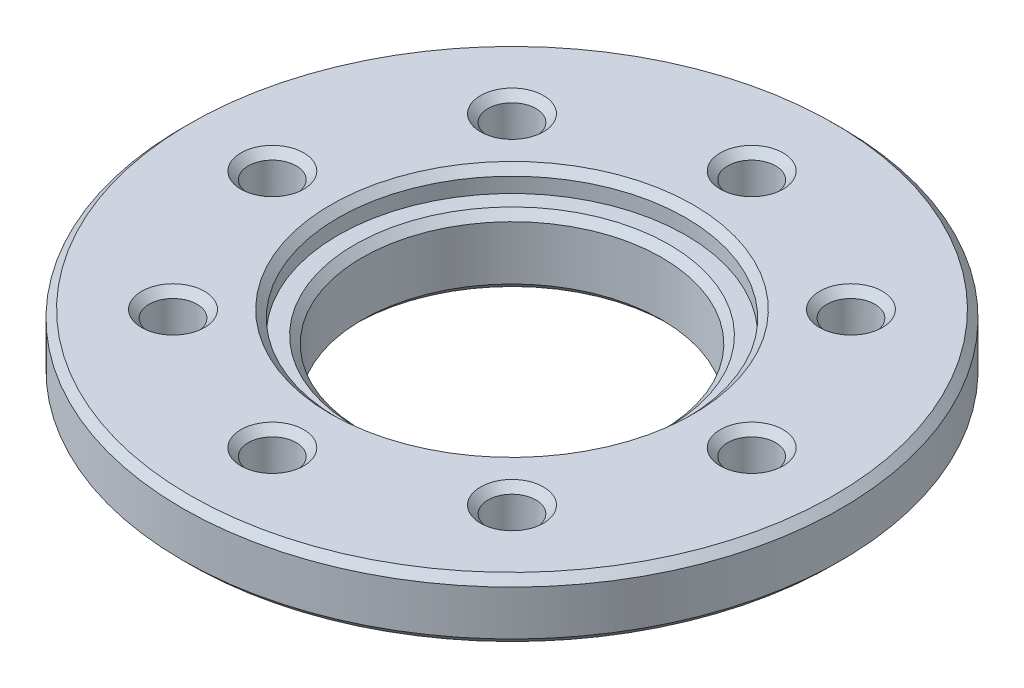
ISO-10303-21;
HEADER;
FILE_DESCRIPTION(('STEP AP214'),'2;1');
FILE_NAME('part.step','',(''),(''),'','','');
FILE_SCHEMA(('AUTOMOTIVE_DESIGN { 1 0 10303 214 1 1 1 1 }'));
ENDSEC;
DATA;
#1=APPLICATION_CONTEXT('core data for automotive mechanical design processes');
#2=APPLICATION_PROTOCOL_DEFINITION('international standard','automotive_design',2000,#1);
#3=PRODUCT_CONTEXT('',#1,'mechanical');
#4=PRODUCT('Part','Part','',(#3));
#5=PRODUCT_RELATED_PRODUCT_CATEGORY('part','',(#4));
#6=PRODUCT_DEFINITION_FORMATION('','',#4);
#7=PRODUCT_DEFINITION_CONTEXT('part definition',#1,'design');
#8=PRODUCT_DEFINITION('design','',#6,#7);
#9=PRODUCT_DEFINITION_SHAPE('','',#8);
#10=(LENGTH_UNIT() NAMED_UNIT(*) SI_UNIT(.MILLI.,.METRE.));
#11=(NAMED_UNIT(*) PLANE_ANGLE_UNIT() SI_UNIT($,.RADIAN.));
#12=(NAMED_UNIT(*) SI_UNIT($,.STERADIAN.) SOLID_ANGLE_UNIT());
#13=UNCERTAINTY_MEASURE_WITH_UNIT(LENGTH_MEASURE(1.E-05),#10,'distance_accuracy_value','');
#14=(GEOMETRIC_REPRESENTATION_CONTEXT(3) GLOBAL_UNCERTAINTY_ASSIGNED_CONTEXT((#13)) GLOBAL_UNIT_ASSIGNED_CONTEXT((#10,
#11,#12)) REPRESENTATION_CONTEXT('',''));
#15=CARTESIAN_POINT('',(0.,0.,0.));
#16=DIRECTION('',(0.,0.,1.));
#17=DIRECTION('',(1.,0.,0.));
#18=AXIS2_PLACEMENT_3D('',#15,#16,#17);
#19=CARTESIAN_POINT('',(0.,0.,0.));
#20=DIRECTION('',(0.,-1.,0.));
#21=DIRECTION('',(0.,0.,-1.));
#22=AXIS2_PLACEMENT_3D('',#19,#20,#21);
#23=CYLINDRICAL_SURFACE('',#22,11.);
#24=CARTESIAN_POINT('',(0.,-1.75000000005246,0.));
#25=DIRECTION('',(0.,-1.,0.));
#26=DIRECTION('',(0.,0.,-1.));
#27=AXIS2_PLACEMENT_3D('',#24,#25,#26);
#28=CIRCLE('',#27,11.);
#29=CARTESIAN_POINT('',(0.,-1.75000000005246,-11.));
#30=VERTEX_POINT('',#29);
#31=EDGE_CURVE('E65',#30,#30,#28,.F.);
#32=ORIENTED_EDGE('',*,*,#31,.T.);
#33=EDGE_LOOP('',(#32));
#34=FACE_BOUND('',#33,.T.);
#35=CARTESIAN_POINT('',(0.,-0.250000000004393,0.));
#36=DIRECTION('',(0.,1.,0.));
#37=DIRECTION('',(0.,0.,1.));
#38=AXIS2_PLACEMENT_3D('',#35,#36,#37);
#39=CIRCLE('',#38,11.);
#40=CARTESIAN_POINT('',(0.,-0.250000000004393,11.));
#41=VERTEX_POINT('',#40);
#42=EDGE_CURVE('E68',#41,#41,#39,.F.);
#43=ORIENTED_EDGE('',*,*,#42,.T.);
#44=EDGE_LOOP('',(#43));
#45=FACE_BOUND('',#44,.T.);
#46=ADVANCED_FACE('F33',(#34,#45),#23,.T.);
#47=CARTESIAN_POINT('',(11.,0.,0.));
#48=DIRECTION('',(0.,1.,0.));
#49=DIRECTION('',(0.,0.,1.));
#50=AXIS2_PLACEMENT_3D('',#47,#48,#49);
#51=PLANE('',#50);
#52=CARTESIAN_POINT('',(8.,0.,0.));
#53=DIRECTION('',(0.,1.,0.));
#54=DIRECTION('',(0.,0.,1.));
#55=AXIS2_PLACEMENT_3D('',#52,#53,#54);
#56=CIRCLE('',#55,1.04999999994757);
#57=CARTESIAN_POINT('',(8.,0.,1.04999999994757));
#58=VERTEX_POINT('',#57);
#59=EDGE_CURVE('E92',#58,#58,#56,.F.);
#60=ORIENTED_EDGE('',*,*,#59,.T.);
#61=EDGE_LOOP('',(#60));
#62=FACE_BOUND('',#61,.T.);
#63=CARTESIAN_POINT('',(-8.,0.,0.));
#64=DIRECTION('',(0.,1.,0.));
#65=DIRECTION('',(0.,0.,1.));
#66=AXIS2_PLACEMENT_3D('',#63,#64,#65);
#67=CIRCLE('',#66,1.04999999994757);
#68=CARTESIAN_POINT('',(-8.,0.,1.04999999994757));
#69=VERTEX_POINT('',#68);
#70=EDGE_CURVE('E95',#69,#69,#67,.F.);
#71=ORIENTED_EDGE('',*,*,#70,.T.);
#72=EDGE_LOOP('',(#71));
#73=FACE_BOUND('',#72,.T.);
#74=CARTESIAN_POINT('',(0.,0.,8.));
#75=DIRECTION('',(0.,1.,0.));
#76=DIRECTION('',(0.,0.,1.));
#77=AXIS2_PLACEMENT_3D('',#74,#75,#76);
#78=CIRCLE('',#77,1.04999999994757);
#79=CARTESIAN_POINT('',(0.,0.,9.04999999994757));
#80=VERTEX_POINT('',#79);
#81=EDGE_CURVE('E98',#80,#80,#78,.F.);
#82=ORIENTED_EDGE('',*,*,#81,.T.);
#83=EDGE_LOOP('',(#82));
#84=FACE_BOUND('',#83,.T.);
#85=CARTESIAN_POINT('',(0.,0.,0.));
#86=DIRECTION('',(0.,1.,0.));
#87=DIRECTION('',(0.,0.,1.));
#88=AXIS2_PLACEMENT_3D('',#85,#86,#87);
#89=CIRCLE('',#88,6.04999999994754);
#90=CARTESIAN_POINT('',(0.,0.,6.04999999994754));
#91=VERTEX_POINT('',#90);
#92=EDGE_CURVE('E101',#91,#91,#89,.F.);
#93=ORIENTED_EDGE('',*,*,#92,.T.);
#94=EDGE_LOOP('',(#93));
#95=FACE_BOUND('',#94,.T.);
#96=CARTESIAN_POINT('',(5.656854249492,0.,5.656854249492));
#97=DIRECTION('',(0.,1.,0.));
#98=DIRECTION('',(0.,0.,1.));
#99=AXIS2_PLACEMENT_3D('',#96,#97,#98);
#100=CIRCLE('',#99,1.04999999994757);
#101=CARTESIAN_POINT('',(5.656854249492,0.,6.70685424943957));
#102=VERTEX_POINT('',#101);
#103=EDGE_CURVE('E104',#102,#102,#100,.F.);
#104=ORIENTED_EDGE('',*,*,#103,.T.);
#105=EDGE_LOOP('',(#104));
#106=FACE_BOUND('',#105,.T.);
#107=CARTESIAN_POINT('',(0.,0.,0.));
#108=DIRECTION('',(0.,1.,0.));
#109=DIRECTION('',(0.,0.,1.));
#110=AXIS2_PLACEMENT_3D('',#107,#108,#109);
#111=CIRCLE('',#110,10.7500000000524);
#112=CARTESIAN_POINT('',(0.,0.,10.7500000000524));
#113=VERTEX_POINT('',#112);
#114=EDGE_CURVE('E107',#113,#113,#111,.T.);
#115=ORIENTED_EDGE('',*,*,#114,.T.);
#116=EDGE_LOOP('',(#115));
#117=FACE_BOUND('',#116,.T.);
#118=CARTESIAN_POINT('',(-5.656854249492,0.,5.656854249492));
#119=DIRECTION('',(0.,1.,0.));
#120=DIRECTION('',(0.,0.,1.));
#121=AXIS2_PLACEMENT_3D('',#118,#119,#120);
#122=CIRCLE('',#121,1.04999999994757);
#123=CARTESIAN_POINT('',(-5.656854249492,0.,6.70685424943957));
#124=VERTEX_POINT('',#123);
#125=EDGE_CURVE('E110',#124,#124,#122,.F.);
#126=ORIENTED_EDGE('',*,*,#125,.T.);
#127=EDGE_LOOP('',(#126));
#128=FACE_BOUND('',#127,.T.);
#129=CARTESIAN_POINT('',(-5.656854249492,0.,-5.656854249492));
#130=DIRECTION('',(0.,1.,0.));
#131=DIRECTION('',(0.,0.,1.));
#132=AXIS2_PLACEMENT_3D('',#129,#130,#131);
#133=CIRCLE('',#132,1.04999999994757);
#134=CARTESIAN_POINT('',(-5.656854249492,0.,-4.60685424954443));
#135=VERTEX_POINT('',#134);
#136=EDGE_CURVE('E113',#135,#135,#133,.F.);
#137=ORIENTED_EDGE('',*,*,#136,.T.);
#138=EDGE_LOOP('',(#137));
#139=FACE_BOUND('',#138,.T.);
#140=CARTESIAN_POINT('',(0.,0.,-8.));
#141=DIRECTION('',(0.,1.,0.));
#142=DIRECTION('',(0.,0.,1.));
#143=AXIS2_PLACEMENT_3D('',#140,#141,#142);
#144=CIRCLE('',#143,1.04999999994757);
#145=CARTESIAN_POINT('',(0.,0.,-6.95000000005243));
#146=VERTEX_POINT('',#145);
#147=EDGE_CURVE('E116',#146,#146,#144,.F.);
#148=ORIENTED_EDGE('',*,*,#147,.T.);
#149=EDGE_LOOP('',(#148));
#150=FACE_BOUND('',#149,.T.);
#151=CARTESIAN_POINT('',(5.656854249492,0.,-5.656854249492));
#152=DIRECTION('',(0.,1.,0.));
#153=DIRECTION('',(0.,0.,1.));
#154=AXIS2_PLACEMENT_3D('',#151,#152,#153);
#155=CIRCLE('',#154,1.04999999994757);
#156=CARTESIAN_POINT('',(5.656854249492,0.,-4.60685424954443));
#157=VERTEX_POINT('',#156);
#158=EDGE_CURVE('E119',#157,#157,#155,.F.);
#159=ORIENTED_EDGE('',*,*,#158,.T.);
#160=EDGE_LOOP('',(#159));
#161=FACE_BOUND('',#160,.T.);
#162=ADVANCED_FACE('F173',(#62,#73,#84,#95,#106,#117,#128,#139,#150,#161),#51,.T.);
#163=CARTESIAN_POINT('',(0.,-2.,0.));
#164=DIRECTION('',(0.,-1.,0.));
#165=DIRECTION('',(0.,0.,-1.));
#166=AXIS2_PLACEMENT_3D('',#163,#164,#165);
#167=PLANE('',#166);
#168=CARTESIAN_POINT('',(0.,-2.,0.));
#169=DIRECTION('',(0.,-1.,0.));
#170=DIRECTION('',(0.,0.,-1.));
#171=AXIS2_PLACEMENT_3D('',#168,#169,#170);
#172=CIRCLE('',#171,10.7499999999956);
#173=CARTESIAN_POINT('',(0.,-2.,-10.7499999999956));
#174=VERTEX_POINT('',#173);
#175=EDGE_CURVE('E71',#174,#174,#172,.T.);
#176=ORIENTED_EDGE('',*,*,#175,.T.);
#177=EDGE_LOOP('',(#176));
#178=FACE_BOUND('',#177,.T.);
#179=CARTESIAN_POINT('',(0.,-2.,-8.));
#180=DIRECTION('',(0.,-1.,0.));
#181=DIRECTION('',(0.,0.,-1.));
#182=AXIS2_PLACEMENT_3D('',#179,#180,#181);
#183=CIRCLE('',#182,0.800000000000014);
#184=CARTESIAN_POINT('',(0.,-2.,-8.80000000000001));
#185=VERTEX_POINT('',#184);
#186=EDGE_CURVE('E126',#185,#185,#183,.T.);
#187=ORIENTED_EDGE('',*,*,#186,.F.);
#188=EDGE_LOOP('',(#187));
#189=FACE_BOUND('',#188,.T.);
#190=CARTESIAN_POINT('',(5.656854249492,-2.,-5.656854249492));
#191=DIRECTION('',(0.,-1.,0.));
#192=DIRECTION('',(0.,0.,-1.));
#193=AXIS2_PLACEMENT_3D('',#190,#191,#192);
#194=CIRCLE('',#193,0.800000000000014);
#195=CARTESIAN_POINT('',(5.656854249492,-2.,-6.45685424949201));
#196=VERTEX_POINT('',#195);
#197=EDGE_CURVE('E129',#196,#196,#194,.T.);
#198=ORIENTED_EDGE('',*,*,#197,.F.);
#199=EDGE_LOOP('',(#198));
#200=FACE_BOUND('',#199,.T.);
#201=CARTESIAN_POINT('',(8.,-2.,0.));
#202=DIRECTION('',(0.,-1.,0.));
#203=DIRECTION('',(0.,0.,-1.));
#204=AXIS2_PLACEMENT_3D('',#201,#202,#203);
#205=CIRCLE('',#204,0.800000000000014);
#206=CARTESIAN_POINT('',(8.,-2.,-0.800000000000014));
#207=VERTEX_POINT('',#206);
#208=EDGE_CURVE('E133',#207,#207,#205,.T.);
#209=ORIENTED_EDGE('',*,*,#208,.F.);
#210=EDGE_LOOP('',(#209));
#211=FACE_BOUND('',#210,.T.);
#212=CARTESIAN_POINT('',(5.656854249492,-2.,5.656854249492));
#213=DIRECTION('',(0.,-1.,0.));
#214=DIRECTION('',(0.,0.,-1.));
#215=AXIS2_PLACEMENT_3D('',#212,#213,#214);
#216=CIRCLE('',#215,0.800000000000014);
#217=CARTESIAN_POINT('',(5.656854249492,-2.,4.85685424949199));
#218=VERTEX_POINT('',#217);
#219=EDGE_CURVE('E148',#218,#218,#216,.T.);
#220=ORIENTED_EDGE('',*,*,#219,.F.);
#221=EDGE_LOOP('',(#220));
#222=FACE_BOUND('',#221,.T.);
#223=CARTESIAN_POINT('',(0.,-2.,8.));
#224=DIRECTION('',(0.,-1.,0.));
#225=DIRECTION('',(0.,0.,-1.));
#226=AXIS2_PLACEMENT_3D('',#223,#224,#225);
#227=CIRCLE('',#226,0.800000000000014);
#228=CARTESIAN_POINT('',(0.,-2.,7.19999999999999));
#229=VERTEX_POINT('',#228);
#230=EDGE_CURVE('E145',#229,#229,#227,.T.);
#231=ORIENTED_EDGE('',*,*,#230,.F.);
#232=EDGE_LOOP('',(#231));
#233=FACE_BOUND('',#232,.T.);
#234=CARTESIAN_POINT('',(-5.656854249492,-2.,5.656854249492));
#235=DIRECTION('',(0.,-1.,0.));
#236=DIRECTION('',(0.,0.,-1.));
#237=AXIS2_PLACEMENT_3D('',#234,#235,#236);
#238=CIRCLE('',#237,0.800000000000014);
#239=CARTESIAN_POINT('',(-5.656854249492,-2.,4.85685424949199));
#240=VERTEX_POINT('',#239);
#241=EDGE_CURVE('E138',#240,#240,#238,.T.);
#242=ORIENTED_EDGE('',*,*,#241,.F.);
#243=EDGE_LOOP('',(#242));
#244=FACE_BOUND('',#243,.T.);
#245=CARTESIAN_POINT('',(-8.,-2.,0.));
#246=DIRECTION('',(0.,-1.,0.));
#247=DIRECTION('',(0.,0.,-1.));
#248=AXIS2_PLACEMENT_3D('',#245,#246,#247);
#249=CIRCLE('',#248,0.800000000000014);
#250=CARTESIAN_POINT('',(-8.,-2.,-0.800000000000014));
#251=VERTEX_POINT('',#250);
#252=EDGE_CURVE('E134',#251,#251,#249,.T.);
#253=ORIENTED_EDGE('',*,*,#252,.F.);
#254=EDGE_LOOP('',(#253));
#255=FACE_BOUND('',#254,.T.);
#256=CARTESIAN_POINT('',(-5.656854249492,-2.,-5.656854249492));
#257=DIRECTION('',(0.,-1.,0.));
#258=DIRECTION('',(0.,0.,-1.));
#259=AXIS2_PLACEMENT_3D('',#256,#257,#258);
#260=CIRCLE('',#259,0.800000000000014);
#261=CARTESIAN_POINT('',(-5.656854249492,-2.,-6.45685424949201));
#262=VERTEX_POINT('',#261);
#263=EDGE_CURVE('E137',#262,#262,#260,.T.);
#264=ORIENTED_EDGE('',*,*,#263,.F.);
#265=EDGE_LOOP('',(#264));
#266=FACE_BOUND('',#265,.T.);
#267=CARTESIAN_POINT('',(0.,-2.,0.));
#268=DIRECTION('',(0.,-1.,0.));
#269=DIRECTION('',(0.,0.,-1.));
#270=AXIS2_PLACEMENT_3D('',#267,#268,#269);
#271=CIRCLE('',#270,6.25);
#272=CARTESIAN_POINT('',(0.,-2.,-6.25));
#273=VERTEX_POINT('',#272);
#274=EDGE_CURVE('E125',#273,#273,#271,.T.);
#275=ORIENTED_EDGE('',*,*,#274,.F.);
#276=EDGE_LOOP('',(#275));
#277=FACE_BOUND('',#276,.T.);
#278=ADVANCED_FACE('F179',(#178,#189,#200,#211,#222,#233,#244,#255,#266,#277),#167,.T.);
#279=CARTESIAN_POINT('',(0.,-3.05,0.));
#280=DIRECTION('',(0.,1.,0.));
#281=DIRECTION('',(0.,0.,1.));
#282=AXIS2_PLACEMENT_3D('',#279,#280,#281);
#283=CYLINDRICAL_SURFACE('',#282,6.25);
#284=CARTESIAN_POINT('',(0.,-2.80000000005244,0.));
#285=DIRECTION('',(0.,-1.,0.));
#286=DIRECTION('',(0.,0.,-1.));
#287=AXIS2_PLACEMENT_3D('',#284,#285,#286);
#288=CIRCLE('',#287,6.25);
#289=CARTESIAN_POINT('',(0.,-2.80000000005244,-6.25));
#290=VERTEX_POINT('',#289);
#291=EDGE_CURVE('E53',#290,#290,#288,.F.);
#292=ORIENTED_EDGE('',*,*,#291,.T.);
#293=EDGE_LOOP('',(#292));
#294=FACE_BOUND('',#293,.T.);
#295=ORIENTED_EDGE('',*,*,#274,.T.);
#296=EDGE_LOOP('',(#295));
#297=FACE_BOUND('',#296,.T.);
#298=ADVANCED_FACE('F277',(#294,#297),#283,.T.);
#299=CARTESIAN_POINT('',(0.,-3.05,0.));
#300=DIRECTION('',(0.,-1.,0.));
#301=DIRECTION('',(0.,0.,-1.));
#302=AXIS2_PLACEMENT_3D('',#299,#300,#301);
#303=PLANE('',#302);
#304=CARTESIAN_POINT('',(0.,-3.05,0.));
#305=DIRECTION('',(0.,-1.,0.));
#306=DIRECTION('',(0.,0.,-1.));
#307=AXIS2_PLACEMENT_3D('',#304,#305,#306);
#308=CIRCLE('',#307,5.25000000000441);
#309=CARTESIAN_POINT('',(0.,-3.05,-5.25000000000441));
#310=VERTEX_POINT('',#309);
#311=EDGE_CURVE('E80',#310,#310,#308,.F.);
#312=ORIENTED_EDGE('',*,*,#311,.T.);
#313=EDGE_LOOP('',(#312));
#314=FACE_BOUND('',#313,.T.);
#315=CARTESIAN_POINT('',(0.,-3.05,0.));
#316=DIRECTION('',(0.,-1.,0.));
#317=DIRECTION('',(0.,0.,-1.));
#318=AXIS2_PLACEMENT_3D('',#315,#316,#317);
#319=CIRCLE('',#318,5.9999999999956);
#320=CARTESIAN_POINT('',(0.,-3.05,-5.9999999999956));
#321=VERTEX_POINT('',#320);
#322=EDGE_CURVE('E83',#321,#321,#319,.T.);
#323=ORIENTED_EDGE('',*,*,#322,.T.);
#324=EDGE_LOOP('',(#323));
#325=FACE_BOUND('',#324,.T.);
#326=ADVANCED_FACE('F273',(#314,#325),#303,.T.);
#327=CARTESIAN_POINT('',(-5.656854249492,0.,-5.656854249492));
#328=DIRECTION('',(0.,1.,0.));
#329=DIRECTION('',(0.,0.,1.));
#330=AXIS2_PLACEMENT_3D('',#327,#328,#329);
#331=CYLINDRICAL_SURFACE('',#330,0.800000000000014);
#332=CARTESIAN_POINT('',(-5.656854249492,-0.250000000004394,-5.656854249492));
#333=DIRECTION('',(0.,1.,0.));
#334=DIRECTION('',(0.,0.,1.));
#335=AXIS2_PLACEMENT_3D('',#332,#333,#334);
#336=CIRCLE('',#335,0.800000000000014);
#337=CARTESIAN_POINT('',(-5.656854249492,-0.250000000004394,-4.85685424949199));
#338=VERTEX_POINT('',#337);
#339=EDGE_CURVE('E48',#338,#338,#336,.T.);
#340=ORIENTED_EDGE('',*,*,#339,.T.);
#341=EDGE_LOOP('',(#340));
#342=FACE_BOUND('',#341,.T.);
#343=ORIENTED_EDGE('',*,*,#263,.T.);
#344=EDGE_LOOP('',(#343));
#345=FACE_BOUND('',#344,.T.);
#346=ADVANCED_FACE('F269',(#342,#345),#331,.F.);
#347=CARTESIAN_POINT('',(-8.,0.,0.));
#348=DIRECTION('',(0.,1.,0.));
#349=DIRECTION('',(0.,0.,1.));
#350=AXIS2_PLACEMENT_3D('',#347,#348,#349);
#351=CYLINDRICAL_SURFACE('',#350,0.800000000000014);
#352=CARTESIAN_POINT('',(-8.,-0.250000000004394,0.));
#353=DIRECTION('',(0.,1.,0.));
#354=DIRECTION('',(0.,0.,1.));
#355=AXIS2_PLACEMENT_3D('',#352,#353,#354);
#356=CIRCLE('',#355,0.800000000000014);
#357=CARTESIAN_POINT('',(-8.,-0.250000000004394,0.800000000000014));
#358=VERTEX_POINT('',#357);
#359=EDGE_CURVE('E89',#358,#358,#356,.T.);
#360=ORIENTED_EDGE('',*,*,#359,.T.);
#361=EDGE_LOOP('',(#360));
#362=FACE_BOUND('',#361,.T.);
#363=ORIENTED_EDGE('',*,*,#252,.T.);
#364=EDGE_LOOP('',(#363));
#365=FACE_BOUND('',#364,.T.);
#366=ADVANCED_FACE('F265',(#362,#365),#351,.F.);
#367=CARTESIAN_POINT('',(-5.656854249492,0.,5.656854249492));
#368=DIRECTION('',(0.,1.,0.));
#369=DIRECTION('',(0.,0.,1.));
#370=AXIS2_PLACEMENT_3D('',#367,#368,#369);
#371=CYLINDRICAL_SURFACE('',#370,0.800000000000014);
#372=CARTESIAN_POINT('',(-5.656854249492,-0.250000000004394,5.656854249492));
#373=DIRECTION('',(0.,1.,0.));
#374=DIRECTION('',(0.,0.,1.));
#375=AXIS2_PLACEMENT_3D('',#372,#373,#374);
#376=CIRCLE('',#375,0.800000000000014);
#377=CARTESIAN_POINT('',(-5.656854249492,-0.250000000004394,6.45685424949201));
#378=VERTEX_POINT('',#377);
#379=EDGE_CURVE('E56',#378,#378,#376,.T.);
#380=ORIENTED_EDGE('',*,*,#379,.T.);
#381=EDGE_LOOP('',(#380));
#382=FACE_BOUND('',#381,.T.);
#383=ORIENTED_EDGE('',*,*,#241,.T.);
#384=EDGE_LOOP('',(#383));
#385=FACE_BOUND('',#384,.T.);
#386=ADVANCED_FACE('F261',(#382,#385),#371,.F.);
#387=CARTESIAN_POINT('',(0.,0.,8.));
#388=DIRECTION('',(0.,1.,0.));
#389=DIRECTION('',(0.,0.,1.));
#390=AXIS2_PLACEMENT_3D('',#387,#388,#389);
#391=CYLINDRICAL_SURFACE('',#390,0.800000000000014);
#392=CARTESIAN_POINT('',(0.,-0.250000000004394,8.));
#393=DIRECTION('',(0.,1.,0.));
#394=DIRECTION('',(0.,0.,1.));
#395=AXIS2_PLACEMENT_3D('',#392,#393,#394);
#396=CIRCLE('',#395,0.800000000000014);
#397=CARTESIAN_POINT('',(0.,-0.250000000004394,8.80000000000001));
#398=VERTEX_POINT('',#397);
#399=EDGE_CURVE('E86',#398,#398,#396,.T.);
#400=ORIENTED_EDGE('',*,*,#399,.T.);
#401=EDGE_LOOP('',(#400));
#402=FACE_BOUND('',#401,.T.);
#403=ORIENTED_EDGE('',*,*,#230,.T.);
#404=EDGE_LOOP('',(#403));
#405=FACE_BOUND('',#404,.T.);
#406=ADVANCED_FACE('F257',(#402,#405),#391,.F.);
#407=CARTESIAN_POINT('',(5.656854249492,0.,5.656854249492));
#408=DIRECTION('',(0.,1.,0.));
#409=DIRECTION('',(0.,0.,1.));
#410=AXIS2_PLACEMENT_3D('',#407,#408,#409);
#411=CYLINDRICAL_SURFACE('',#410,0.800000000000014);
#412=CARTESIAN_POINT('',(5.656854249492,-0.250000000004394,5.656854249492));
#413=DIRECTION('',(0.,1.,0.));
#414=DIRECTION('',(0.,0.,1.));
#415=AXIS2_PLACEMENT_3D('',#412,#413,#414);
#416=CIRCLE('',#415,0.800000000000014);
#417=CARTESIAN_POINT('',(5.656854249492,-0.250000000004394,6.45685424949201));
#418=VERTEX_POINT('',#417);
#419=EDGE_CURVE('E59',#418,#418,#416,.T.);
#420=ORIENTED_EDGE('',*,*,#419,.T.);
#421=EDGE_LOOP('',(#420));
#422=FACE_BOUND('',#421,.T.);
#423=ORIENTED_EDGE('',*,*,#219,.T.);
#424=EDGE_LOOP('',(#423));
#425=FACE_BOUND('',#424,.T.);
#426=ADVANCED_FACE('F253',(#422,#425),#411,.F.);
#427=CARTESIAN_POINT('',(8.,0.,0.));
#428=DIRECTION('',(0.,1.,0.));
#429=DIRECTION('',(0.,0.,1.));
#430=AXIS2_PLACEMENT_3D('',#427,#428,#429);
#431=CYLINDRICAL_SURFACE('',#430,0.800000000000014);
#432=CARTESIAN_POINT('',(8.,-0.250000000004394,0.));
#433=DIRECTION('',(0.,1.,0.));
#434=DIRECTION('',(0.,0.,1.));
#435=AXIS2_PLACEMENT_3D('',#432,#433,#434);
#436=CIRCLE('',#435,0.800000000000014);
#437=CARTESIAN_POINT('',(8.,-0.250000000004394,0.800000000000014));
#438=VERTEX_POINT('',#437);
#439=EDGE_CURVE('E122',#438,#438,#436,.T.);
#440=ORIENTED_EDGE('',*,*,#439,.T.);
#441=EDGE_LOOP('',(#440));
#442=FACE_BOUND('',#441,.T.);
#443=ORIENTED_EDGE('',*,*,#208,.T.);
#444=EDGE_LOOP('',(#443));
#445=FACE_BOUND('',#444,.T.);
#446=ADVANCED_FACE('F250',(#442,#445),#431,.F.);
#447=CARTESIAN_POINT('',(5.656854249492,0.,-5.656854249492));
#448=DIRECTION('',(0.,1.,0.));
#449=DIRECTION('',(0.,0.,1.));
#450=AXIS2_PLACEMENT_3D('',#447,#448,#449);
#451=CYLINDRICAL_SURFACE('',#450,0.800000000000014);
#452=CARTESIAN_POINT('',(5.656854249492,-0.250000000004394,-5.656854249492));
#453=DIRECTION('',(0.,1.,0.));
#454=DIRECTION('',(0.,0.,1.));
#455=AXIS2_PLACEMENT_3D('',#452,#453,#454);
#456=CIRCLE('',#455,0.800000000000014);
#457=CARTESIAN_POINT('',(5.656854249492,-0.250000000004394,-4.85685424949199));
#458=VERTEX_POINT('',#457);
#459=EDGE_CURVE('E10',#458,#458,#456,.T.);
#460=ORIENTED_EDGE('',*,*,#459,.T.);
#461=EDGE_LOOP('',(#460));
#462=FACE_BOUND('',#461,.T.);
#463=ORIENTED_EDGE('',*,*,#197,.T.);
#464=EDGE_LOOP('',(#463));
#465=FACE_BOUND('',#464,.T.);
#466=ADVANCED_FACE('F244',(#462,#465),#451,.F.);
#467=CARTESIAN_POINT('',(0.,0.,-8.));
#468=DIRECTION('',(0.,1.,0.));
#469=DIRECTION('',(0.,0.,1.));
#470=AXIS2_PLACEMENT_3D('',#467,#468,#469);
#471=CYLINDRICAL_SURFACE('',#470,0.800000000000014);
#472=CARTESIAN_POINT('',(0.,-0.250000000004394,-8.));
#473=DIRECTION('',(0.,1.,0.));
#474=DIRECTION('',(0.,0.,1.));
#475=AXIS2_PLACEMENT_3D('',#472,#473,#474);
#476=CIRCLE('',#475,0.800000000000014);
#477=CARTESIAN_POINT('',(0.,-0.250000000004394,-7.19999999999999));
#478=VERTEX_POINT('',#477);
#479=EDGE_CURVE('E44',#478,#478,#476,.T.);
#480=ORIENTED_EDGE('',*,*,#479,.T.);
#481=EDGE_LOOP('',(#480));
#482=FACE_BOUND('',#481,.T.);
#483=ORIENTED_EDGE('',*,*,#186,.T.);
#484=EDGE_LOOP('',(#483));
#485=FACE_BOUND('',#484,.T.);
#486=ADVANCED_FACE('F238',(#482,#485),#471,.F.);
#487=CARTESIAN_POINT('',(0.,0.,0.));
#488=DIRECTION('',(0.,1.,0.));
#489=DIRECTION('',(0.,0.,1.));
#490=AXIS2_PLACEMENT_3D('',#487,#488,#489);
#491=CYLINDRICAL_SURFACE('',#490,5.00000000000001);
#492=CARTESIAN_POINT('',(0.,-2.80000000005244,0.));
#493=DIRECTION('',(0.,-1.,0.));
#494=DIRECTION('',(0.,0.,-1.));
#495=AXIS2_PLACEMENT_3D('',#492,#493,#494);
#496=CIRCLE('',#495,5.00000000000001);
#497=CARTESIAN_POINT('',(0.,-2.80000000005244,-5.00000000000001));
#498=VERTEX_POINT('',#497);
#499=EDGE_CURVE('E74',#498,#498,#496,.T.);
#500=ORIENTED_EDGE('',*,*,#499,.T.);
#501=EDGE_LOOP('',(#500));
#502=FACE_BOUND('',#501,.T.);
#503=CARTESIAN_POINT('',(0.,-1.00000000000439,0.));
#504=DIRECTION('',(0.,-1.,0.));
#505=DIRECTION('',(0.,0.,-1.));
#506=AXIS2_PLACEMENT_3D('',#503,#504,#505);
#507=CIRCLE('',#506,5.00000000000001);
#508=CARTESIAN_POINT('',(0.,-1.00000000000439,-5.00000000000001));
#509=VERTEX_POINT('',#508);
#510=EDGE_CURVE('E77',#509,#509,#507,.F.);
#511=ORIENTED_EDGE('',*,*,#510,.T.);
#512=EDGE_LOOP('',(#511));
#513=FACE_BOUND('',#512,.T.);
#514=ADVANCED_FACE('F170',(#502,#513),#491,.F.);
#515=CARTESIAN_POINT('',(5.00000000000001,-0.750000000000001,0.));
#516=DIRECTION('',(0.,-1.,0.));
#517=DIRECTION('',(0.,0.,-1.));
#518=AXIS2_PLACEMENT_3D('',#515,#516,#517);
#519=PLANE('',#518);
#520=CARTESIAN_POINT('',(0.,-0.750000000000001,0.));
#521=DIRECTION('',(0.,-1.,0.));
#522=DIRECTION('',(0.,0.,-1.));
#523=AXIS2_PLACEMENT_3D('',#520,#521,#522);
#524=CIRCLE('',#523,5.24999999994756);
#525=CARTESIAN_POINT('',(0.,-0.750000000000001,-5.24999999994756));
#526=VERTEX_POINT('',#525);
#527=EDGE_CURVE('E40',#526,#526,#524,.T.);
#528=ORIENTED_EDGE('',*,*,#527,.T.);
#529=EDGE_LOOP('',(#528));
#530=FACE_BOUND('',#529,.T.);
#531=CARTESIAN_POINT('',(0.,-0.750000000000001,0.));
#532=DIRECTION('',(0.,1.,0.));
#533=DIRECTION('',(0.,0.,1.));
#534=AXIS2_PLACEMENT_3D('',#531,#532,#533);
#535=CIRCLE('',#534,5.8);
#536=CARTESIAN_POINT('',(0.,-0.750000000000001,5.8));
#537=VERTEX_POINT('',#536);
#538=EDGE_CURVE('E130',#537,#537,#535,.T.);
#539=ORIENTED_EDGE('',*,*,#538,.T.);
#540=EDGE_LOOP('',(#539));
#541=FACE_BOUND('',#540,.T.);
#542=ADVANCED_FACE('F156',(#530,#541),#519,.F.);
#543=CARTESIAN_POINT('',(0.,0.,0.));
#544=DIRECTION('',(0.,1.,0.));
#545=DIRECTION('',(0.,0.,1.));
#546=AXIS2_PLACEMENT_3D('',#543,#544,#545);
#547=CYLINDRICAL_SURFACE('',#546,5.8);
#548=CARTESIAN_POINT('',(0.,-0.250000000004392,0.));
#549=DIRECTION('',(0.,1.,0.));
#550=DIRECTION('',(0.,0.,1.));
#551=AXIS2_PLACEMENT_3D('',#548,#549,#550);
#552=CIRCLE('',#551,5.8);
#553=CARTESIAN_POINT('',(0.,-0.250000000004392,5.8));
#554=VERTEX_POINT('',#553);
#555=EDGE_CURVE('E62',#554,#554,#552,.T.);
#556=ORIENTED_EDGE('',*,*,#555,.T.);
#557=EDGE_LOOP('',(#556));
#558=FACE_BOUND('',#557,.T.);
#559=ORIENTED_EDGE('',*,*,#538,.F.);
#560=EDGE_LOOP('',(#559));
#561=FACE_BOUND('',#560,.T.);
#562=ADVANCED_FACE('F158',(#558,#561),#547,.F.);
#563=CARTESIAN_POINT('',(8.,-0.250000000004394,0.));
#564=DIRECTION('',(0.,1.,0.));
#565=DIRECTION('',(0.,0.,1.));
#566=AXIS2_PLACEMENT_3D('',#563,#564,#565);
#567=CONICAL_SURFACE('',#566,0.800000000000014,0.78539816328377);
#568=ORIENTED_EDGE('',*,*,#59,.F.);
#569=EDGE_LOOP('',(#568));
#570=FACE_BOUND('',#569,.T.);
#571=ORIENTED_EDGE('',*,*,#439,.F.);
#572=EDGE_LOOP('',(#571));
#573=FACE_BOUND('',#572,.T.);
#574=ADVANCED_FACE('F160',(#570,#573),#567,.F.);
#575=CARTESIAN_POINT('',(-8.,-0.250000000004394,0.));
#576=DIRECTION('',(0.,1.,0.));
#577=DIRECTION('',(0.,0.,1.));
#578=AXIS2_PLACEMENT_3D('',#575,#576,#577);
#579=CONICAL_SURFACE('',#578,0.800000000000014,0.78539816328377);
#580=ORIENTED_EDGE('',*,*,#70,.F.);
#581=EDGE_LOOP('',(#580));
#582=FACE_BOUND('',#581,.T.);
#583=ORIENTED_EDGE('',*,*,#359,.F.);
#584=EDGE_LOOP('',(#583));
#585=FACE_BOUND('',#584,.T.);
#586=ADVANCED_FACE('F167',(#582,#585),#579,.F.);
#587=CARTESIAN_POINT('',(0.,-0.250000000004394,8.));
#588=DIRECTION('',(0.,1.,0.));
#589=DIRECTION('',(0.,0.,1.));
#590=AXIS2_PLACEMENT_3D('',#587,#588,#589);
#591=CONICAL_SURFACE('',#590,0.800000000000014,0.78539816328377);
#592=ORIENTED_EDGE('',*,*,#81,.F.);
#593=EDGE_LOOP('',(#592));
#594=FACE_BOUND('',#593,.T.);
#595=ORIENTED_EDGE('',*,*,#399,.F.);
#596=EDGE_LOOP('',(#595));
#597=FACE_BOUND('',#596,.T.);
#598=ADVANCED_FACE('F187',(#594,#597),#591,.F.);
#599=CARTESIAN_POINT('',(0.,-3.05,0.));
#600=DIRECTION('',(0.,-1.,0.));
#601=DIRECTION('',(0.,0.,-1.));
#602=AXIS2_PLACEMENT_3D('',#599,#600,#601);
#603=CONICAL_SURFACE('',#602,5.25000000000441,0.785398163511128);
#604=ORIENTED_EDGE('',*,*,#499,.F.);
#605=EDGE_LOOP('',(#604));
#606=FACE_BOUND('',#605,.T.);
#607=ORIENTED_EDGE('',*,*,#311,.F.);
#608=EDGE_LOOP('',(#607));
#609=FACE_BOUND('',#608,.T.);
#610=ADVANCED_FACE('F191',(#606,#609),#603,.F.);
#611=CARTESIAN_POINT('',(0.,-2.,0.));
#612=DIRECTION('',(0.,1.,0.));
#613=DIRECTION('',(0.,0.,1.));
#614=AXIS2_PLACEMENT_3D('',#611,#612,#613);
#615=CONICAL_SURFACE('',#614,10.7499999999956,0.785398163511132);
#616=ORIENTED_EDGE('',*,*,#31,.F.);
#617=EDGE_LOOP('',(#616));
#618=FACE_BOUND('',#617,.T.);
#619=ORIENTED_EDGE('',*,*,#175,.F.);
#620=EDGE_LOOP('',(#619));
#621=FACE_BOUND('',#620,.T.);
#622=ADVANCED_FACE('F195',(#618,#621),#615,.T.);
#623=CARTESIAN_POINT('',(0.,-0.250000000004392,0.));
#624=DIRECTION('',(0.,1.,0.));
#625=DIRECTION('',(0.,0.,1.));
#626=AXIS2_PLACEMENT_3D('',#623,#624,#625);
#627=CONICAL_SURFACE('',#626,5.8,0.785398163283763);
#628=ORIENTED_EDGE('',*,*,#92,.F.);
#629=EDGE_LOOP('',(#628));
#630=FACE_BOUND('',#629,.T.);
#631=ORIENTED_EDGE('',*,*,#555,.F.);
#632=EDGE_LOOP('',(#631));
#633=FACE_BOUND('',#632,.T.);
#634=ADVANCED_FACE('F199',(#630,#633),#627,.F.);
#635=CARTESIAN_POINT('',(5.656854249492,-0.250000000004394,5.656854249492));
#636=DIRECTION('',(0.,1.,0.));
#637=DIRECTION('',(0.,0.,1.));
#638=AXIS2_PLACEMENT_3D('',#635,#636,#637);
#639=CONICAL_SURFACE('',#638,0.800000000000014,0.785398163283768);
#640=ORIENTED_EDGE('',*,*,#103,.F.);
#641=EDGE_LOOP('',(#640));
#642=FACE_BOUND('',#641,.T.);
#643=ORIENTED_EDGE('',*,*,#419,.F.);
#644=EDGE_LOOP('',(#643));
#645=FACE_BOUND('',#644,.T.);
#646=ADVANCED_FACE('F203',(#642,#645),#639,.F.);
#647=CARTESIAN_POINT('',(0.,-0.250000000004393,0.));
#648=DIRECTION('',(0.,-1.,0.));
#649=DIRECTION('',(0.,0.,-1.));
#650=AXIS2_PLACEMENT_3D('',#647,#648,#649);
#651=CONICAL_SURFACE('',#650,11.,0.785398163283772);
#652=ORIENTED_EDGE('',*,*,#114,.F.);
#653=EDGE_LOOP('',(#652));
#654=FACE_BOUND('',#653,.T.);
#655=ORIENTED_EDGE('',*,*,#42,.F.);
#656=EDGE_LOOP('',(#655));
#657=FACE_BOUND('',#656,.T.);
#658=ADVANCED_FACE('F207',(#654,#657),#651,.T.);
#659=CARTESIAN_POINT('',(-5.656854249492,-0.250000000004394,5.656854249492));
#660=DIRECTION('',(0.,1.,0.));
#661=DIRECTION('',(0.,0.,1.));
#662=AXIS2_PLACEMENT_3D('',#659,#660,#661);
#663=CONICAL_SURFACE('',#662,0.800000000000014,0.785398163283768);
#664=ORIENTED_EDGE('',*,*,#125,.F.);
#665=EDGE_LOOP('',(#664));
#666=FACE_BOUND('',#665,.T.);
#667=ORIENTED_EDGE('',*,*,#379,.F.);
#668=EDGE_LOOP('',(#667));
#669=FACE_BOUND('',#668,.T.);
#670=ADVANCED_FACE('F211',(#666,#669),#663,.F.);
#671=CARTESIAN_POINT('',(0.,-3.05,0.));
#672=DIRECTION('',(0.,1.,0.));
#673=DIRECTION('',(0.,0.,1.));
#674=AXIS2_PLACEMENT_3D('',#671,#672,#673);
#675=CONICAL_SURFACE('',#674,5.9999999999956,0.785398163511133);
#676=ORIENTED_EDGE('',*,*,#291,.F.);
#677=EDGE_LOOP('',(#676));
#678=FACE_BOUND('',#677,.T.);
#679=ORIENTED_EDGE('',*,*,#322,.F.);
#680=EDGE_LOOP('',(#679));
#681=FACE_BOUND('',#680,.T.);
#682=ADVANCED_FACE('F215',(#678,#681),#675,.T.);
#683=CARTESIAN_POINT('',(-5.656854249492,-0.250000000004394,-5.656854249492));
#684=DIRECTION('',(0.,1.,0.));
#685=DIRECTION('',(0.,0.,1.));
#686=AXIS2_PLACEMENT_3D('',#683,#684,#685);
#687=CONICAL_SURFACE('',#686,0.800000000000014,0.785398163283768);
#688=ORIENTED_EDGE('',*,*,#136,.F.);
#689=EDGE_LOOP('',(#688));
#690=FACE_BOUND('',#689,.T.);
#691=ORIENTED_EDGE('',*,*,#339,.F.);
#692=EDGE_LOOP('',(#691));
#693=FACE_BOUND('',#692,.T.);
#694=ADVANCED_FACE('F219',(#690,#693),#687,.F.);
#695=CARTESIAN_POINT('',(0.,-0.250000000004394,-8.));
#696=DIRECTION('',(0.,1.,0.));
#697=DIRECTION('',(0.,0.,1.));
#698=AXIS2_PLACEMENT_3D('',#695,#696,#697);
#699=CONICAL_SURFACE('',#698,0.800000000000014,0.78539816328377);
#700=ORIENTED_EDGE('',*,*,#147,.F.);
#701=EDGE_LOOP('',(#700));
#702=FACE_BOUND('',#701,.T.);
#703=ORIENTED_EDGE('',*,*,#479,.F.);
#704=EDGE_LOOP('',(#703));
#705=FACE_BOUND('',#704,.T.);
#706=ADVANCED_FACE('F223',(#702,#705),#699,.F.);
#707=CARTESIAN_POINT('',(0.,-1.00000000000439,0.));
#708=DIRECTION('',(0.,1.,0.));
#709=DIRECTION('',(0.,0.,1.));
#710=AXIS2_PLACEMENT_3D('',#707,#708,#709);
#711=CONICAL_SURFACE('',#710,5.00000000000001,0.785398163283768);
#712=ORIENTED_EDGE('',*,*,#527,.F.);
#713=EDGE_LOOP('',(#712));
#714=FACE_BOUND('',#713,.T.);
#715=ORIENTED_EDGE('',*,*,#510,.F.);
#716=EDGE_LOOP('',(#715));
#717=FACE_BOUND('',#716,.T.);
#718=ADVANCED_FACE('F226',(#714,#717),#711,.F.);
#719=CARTESIAN_POINT('',(5.656854249492,-0.250000000004394,-5.656854249492));
#720=DIRECTION('',(0.,1.,0.));
#721=DIRECTION('',(0.,0.,1.));
#722=AXIS2_PLACEMENT_3D('',#719,#720,#721);
#723=CONICAL_SURFACE('',#722,0.800000000000014,0.785398163283768);
#724=ORIENTED_EDGE('',*,*,#158,.F.);
#725=EDGE_LOOP('',(#724));
#726=FACE_BOUND('',#725,.T.);
#727=ORIENTED_EDGE('',*,*,#459,.F.);
#728=EDGE_LOOP('',(#727));
#729=FACE_BOUND('',#728,.T.);
#730=ADVANCED_FACE('F35',(#726,#729),#723,.F.);
#731=CLOSED_SHELL('',(#46,#162,#278,#298,#326,#346,#366,#386,#406,#426,#446,#466,#486,#514,#542,
#562,#574,#586,#598,#610,#622,#634,#646,#658,#670,#682,#694,#706,#718,#730));
#732=MANIFOLD_SOLID_BREP('B2',#731);
#733=ADVANCED_BREP_SHAPE_REPRESENTATION('',(#18,#732),#14);
#734=SHAPE_DEFINITION_REPRESENTATION(#9,#733);
ENDSEC;
END-ISO-10303-21;
